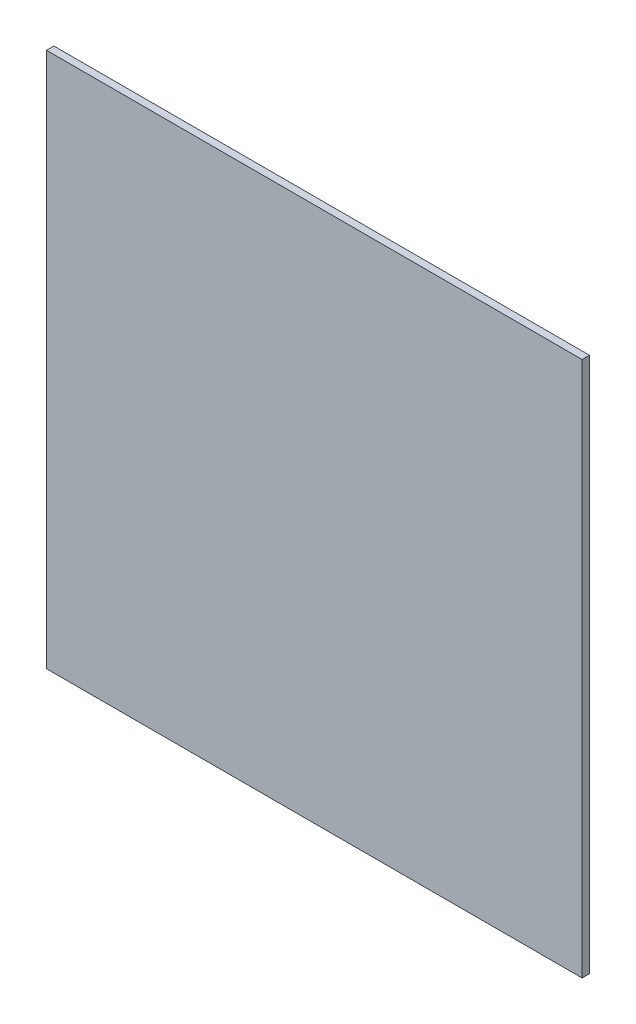
ISO-10303-21;
HEADER;
FILE_DESCRIPTION(('STEP AP214'),'2;1');
FILE_NAME('part.step','',(''),(''),'','','');
FILE_SCHEMA(('AUTOMOTIVE_DESIGN { 1 0 10303 214 1 1 1 1 }'));
ENDSEC;
DATA;
#1=APPLICATION_CONTEXT('core data for automotive mechanical design processes');
#2=APPLICATION_PROTOCOL_DEFINITION('international standard','automotive_design',2000,#1);
#3=PRODUCT_CONTEXT('',#1,'mechanical');
#4=PRODUCT('Part','Part','',(#3));
#5=PRODUCT_RELATED_PRODUCT_CATEGORY('part','',(#4));
#6=PRODUCT_DEFINITION_FORMATION('','',#4);
#7=PRODUCT_DEFINITION_CONTEXT('part definition',#1,'design');
#8=PRODUCT_DEFINITION('design','',#6,#7);
#9=PRODUCT_DEFINITION_SHAPE('','',#8);
#10=(LENGTH_UNIT() NAMED_UNIT(*) SI_UNIT(.MILLI.,.METRE.));
#11=(NAMED_UNIT(*) PLANE_ANGLE_UNIT() SI_UNIT($,.RADIAN.));
#12=(NAMED_UNIT(*) SI_UNIT($,.STERADIAN.) SOLID_ANGLE_UNIT());
#13=UNCERTAINTY_MEASURE_WITH_UNIT(LENGTH_MEASURE(1.E-05),#10,'distance_accuracy_value','');
#14=(GEOMETRIC_REPRESENTATION_CONTEXT(3) GLOBAL_UNCERTAINTY_ASSIGNED_CONTEXT((#13)) GLOBAL_UNIT_ASSIGNED_CONTEXT((#10,
#11,#12)) REPRESENTATION_CONTEXT('',''));
#15=CARTESIAN_POINT('',(0.,0.,0.));
#16=DIRECTION('',(0.,0.,1.));
#17=DIRECTION('',(1.,0.,0.));
#18=AXIS2_PLACEMENT_3D('',#15,#16,#17);
#19=CARTESIAN_POINT('',(-0.028320699595436,0.,0.0200000000000004));
#20=DIRECTION('',(0.,0.,1.));
#21=DIRECTION('',(1.,0.,0.));
#22=AXIS2_PLACEMENT_3D('',#19,#20,#21);
#23=PLANE('',#22);
#24=DIRECTION('',(1.,0.,0.));
#25=VECTOR('',#24,1.);
#26=CARTESIAN_POINT('',(-0.0283206995954357,-0.725,0.02));
#27=LINE('',#26,#25);
#28=CARTESIAN_POINT('',(-0.753320699595435,-0.725,0.02));
#29=VERTEX_POINT('',#28);
#30=CARTESIAN_POINT('',(0.696679300404564,-0.725,0.0200000000000006));
#31=VERTEX_POINT('',#30);
#32=EDGE_CURVE('E21',#29,#31,#27,.T.);
#33=ORIENTED_EDGE('',*,*,#32,.T.);
#34=DIRECTION('',(0.,-1.,0.));
#35=VECTOR('',#34,1.);
#36=CARTESIAN_POINT('',(0.696679300404564,0.,0.0200000000000004));
#37=LINE('',#36,#35);
#38=CARTESIAN_POINT('',(0.696679300404564,0.725,0.0200000000000004));
#39=VERTEX_POINT('',#38);
#40=EDGE_CURVE('E83',#39,#31,#37,.T.);
#41=ORIENTED_EDGE('',*,*,#40,.F.);
#42=DIRECTION('',(1.,0.,0.));
#43=VECTOR('',#42,1.);
#44=CARTESIAN_POINT('',(-0.0283206995954357,0.725,0.02));
#45=LINE('',#44,#43);
#46=CARTESIAN_POINT('',(-0.753320699595435,0.725,0.02));
#47=VERTEX_POINT('',#46);
#48=EDGE_CURVE('E78',#47,#39,#45,.T.);
#49=ORIENTED_EDGE('',*,*,#48,.F.);
#50=DIRECTION('',(0.,-1.,0.));
#51=VECTOR('',#50,1.);
#52=CARTESIAN_POINT('',(-0.753320699595435,0.,0.02));
#53=LINE('',#52,#51);
#54=EDGE_CURVE('E11',#47,#29,#53,.T.);
#55=ORIENTED_EDGE('',*,*,#54,.T.);
#56=EDGE_LOOP('',(#33,#41,#49,#55));
#57=FACE_BOUND('',#56,.T.);
#58=ADVANCED_FACE('F17',(#57),#23,.T.);
#59=CARTESIAN_POINT('',(-0.753320699595435,0.,0.01));
#60=DIRECTION('',(1.,0.,0.));
#61=DIRECTION('',(0.,0.,1.));
#62=AXIS2_PLACEMENT_3D('',#59,#60,#61);
#63=PLANE('',#62);
#64=DIRECTION('',(0.,0.,1.));
#65=VECTOR('',#64,1.);
#66=CARTESIAN_POINT('',(-0.753320699595435,0.725,0.0100000000000002));
#67=LINE('',#66,#65);
#68=CARTESIAN_POINT('',(-0.753320699595435,0.725,0.));
#69=VERTEX_POINT('',#68);
#70=EDGE_CURVE('E73',#69,#47,#67,.T.);
#71=ORIENTED_EDGE('',*,*,#70,.F.);
#72=DIRECTION('',(0.,-1.,0.));
#73=VECTOR('',#72,1.);
#74=CARTESIAN_POINT('',(-0.753320699595435,0.,0.));
#75=LINE('',#74,#73);
#76=CARTESIAN_POINT('',(-0.753320699595435,-0.725,0.));
#77=VERTEX_POINT('',#76);
#78=EDGE_CURVE('E96',#69,#77,#75,.T.);
#79=ORIENTED_EDGE('',*,*,#78,.T.);
#80=DIRECTION('',(0.,0.,1.));
#81=VECTOR('',#80,1.);
#82=CARTESIAN_POINT('',(-0.753320699595435,-0.725,0.0100000000000005));
#83=LINE('',#82,#81);
#84=EDGE_CURVE('E27',#77,#29,#83,.T.);
#85=ORIENTED_EDGE('',*,*,#84,.T.);
#86=ORIENTED_EDGE('',*,*,#54,.F.);
#87=EDGE_LOOP('',(#71,#79,#85,#86));
#88=FACE_BOUND('',#87,.T.);
#89=ADVANCED_FACE('F19',(#88),#63,.F.);
#90=CARTESIAN_POINT('',(-0.0283206995954357,-0.725,0.0100000000000005));
#91=DIRECTION('',(0.,1.,0.));
#92=DIRECTION('',(1.,0.,0.));
#93=AXIS2_PLACEMENT_3D('',#90,#91,#92);
#94=PLANE('',#93);
#95=DIRECTION('',(1.,0.,0.));
#96=VECTOR('',#95,1.);
#97=CARTESIAN_POINT('',(-0.0283206995954357,-0.725,0.));
#98=LINE('',#97,#96);
#99=CARTESIAN_POINT('',(0.696679300404564,-0.725,0.));
#100=VERTEX_POINT('',#99);
#101=EDGE_CURVE('E114',#77,#100,#98,.T.);
#102=ORIENTED_EDGE('',*,*,#101,.T.);
#103=DIRECTION('',(0.,0.,-1.));
#104=VECTOR('',#103,1.);
#105=CARTESIAN_POINT('',(0.696679300404564,-0.725,0.0100000000000007));
#106=LINE('',#105,#104);
#107=EDGE_CURVE('E101',#31,#100,#106,.T.);
#108=ORIENTED_EDGE('',*,*,#107,.F.);
#109=ORIENTED_EDGE('',*,*,#32,.F.);
#110=ORIENTED_EDGE('',*,*,#84,.F.);
#111=EDGE_LOOP('',(#102,#108,#109,#110));
#112=FACE_BOUND('',#111,.T.);
#113=ADVANCED_FACE('F129',(#112),#94,.F.);
#114=CARTESIAN_POINT('',(0.696679300404564,0.,0.0100000000000007));
#115=DIRECTION('',(1.,0.,0.));
#116=DIRECTION('',(0.,0.,-1.));
#117=AXIS2_PLACEMENT_3D('',#114,#115,#116);
#118=PLANE('',#117);
#119=DIRECTION('',(0.,1.,0.));
#120=VECTOR('',#119,1.);
#121=CARTESIAN_POINT('',(0.696679300404564,0.,0.));
#122=LINE('',#121,#120);
#123=CARTESIAN_POINT('',(0.696679300404564,0.725,0.));
#124=VERTEX_POINT('',#123);
#125=EDGE_CURVE('E117',#100,#124,#122,.T.);
#126=ORIENTED_EDGE('',*,*,#125,.T.);
#127=DIRECTION('',(0.,0.,-1.));
#128=VECTOR('',#127,1.);
#129=CARTESIAN_POINT('',(0.696679300404564,0.725,0.0100000000000002));
#130=LINE('',#129,#128);
#131=EDGE_CURVE('E84',#39,#124,#130,.T.);
#132=ORIENTED_EDGE('',*,*,#131,.F.);
#133=ORIENTED_EDGE('',*,*,#40,.T.);
#134=ORIENTED_EDGE('',*,*,#107,.T.);
#135=EDGE_LOOP('',(#126,#132,#133,#134));
#136=FACE_BOUND('',#135,.T.);
#137=ADVANCED_FACE('F124',(#136),#118,.T.);
#138=CARTESIAN_POINT('',(-0.0283206995954357,0.725,0.0100000000000002));
#139=DIRECTION('',(0.,1.,0.));
#140=DIRECTION('',(0.,0.,-1.));
#141=AXIS2_PLACEMENT_3D('',#138,#139,#140);
#142=PLANE('',#141);
#143=ORIENTED_EDGE('',*,*,#48,.T.);
#144=ORIENTED_EDGE('',*,*,#131,.T.);
#145=DIRECTION('',(-1.,0.,0.));
#146=VECTOR('',#145,1.);
#147=CARTESIAN_POINT('',(-0.0283206995954357,0.725,0.));
#148=LINE('',#147,#146);
#149=EDGE_CURVE('E80',#124,#69,#148,.T.);
#150=ORIENTED_EDGE('',*,*,#149,.T.);
#151=ORIENTED_EDGE('',*,*,#70,.T.);
#152=EDGE_LOOP('',(#143,#144,#150,#151));
#153=FACE_BOUND('',#152,.T.);
#154=ADVANCED_FACE('F77',(#153),#142,.T.);
#155=CARTESIAN_POINT('',(-0.0283206995954357,0.,0.));
#156=DIRECTION('',(0.,0.,1.));
#157=DIRECTION('',(1.,0.,0.));
#158=AXIS2_PLACEMENT_3D('',#155,#156,#157);
#159=PLANE('',#158);
#160=ORIENTED_EDGE('',*,*,#125,.F.);
#161=ORIENTED_EDGE('',*,*,#101,.F.);
#162=ORIENTED_EDGE('',*,*,#78,.F.);
#163=ORIENTED_EDGE('',*,*,#149,.F.);
#164=EDGE_LOOP('',(#160,#161,#162,#163));
#165=FACE_BOUND('',#164,.T.);
#166=ADVANCED_FACE('F127',(#165),#159,.F.);
#167=CLOSED_SHELL('',(#58,#89,#113,#137,#154,#166));
#168=MANIFOLD_SOLID_BREP('B1',#167);
#169=ADVANCED_BREP_SHAPE_REPRESENTATION('',(#18,#168),#14);
#170=SHAPE_DEFINITION_REPRESENTATION(#9,#169);
ENDSEC;
END-ISO-10303-21;
